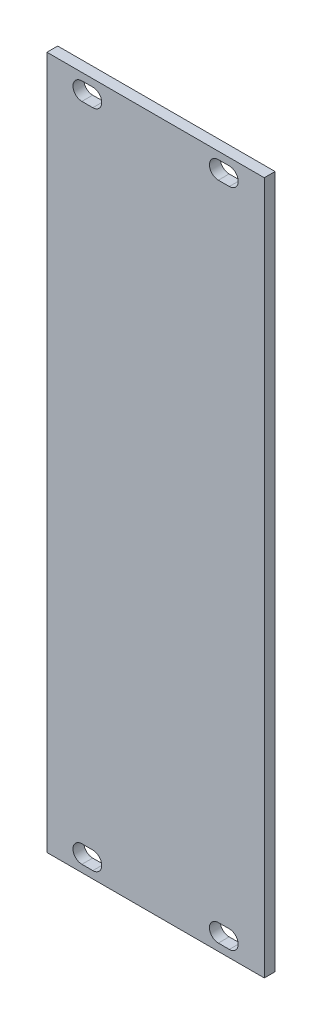
ISO-10303-21;
HEADER;
FILE_DESCRIPTION(('STEP AP214'),'2;1');
FILE_NAME('part.step','',(''),(''),'','','');
FILE_SCHEMA(('AUTOMOTIVE_DESIGN { 1 0 10303 214 1 1 1 1 }'));
ENDSEC;
DATA;
#1=APPLICATION_CONTEXT('core data for automotive mechanical design processes');
#2=APPLICATION_PROTOCOL_DEFINITION('international standard','automotive_design',2000,#1);
#3=PRODUCT_CONTEXT('',#1,'mechanical');
#4=PRODUCT('Part','Part','',(#3));
#5=PRODUCT_RELATED_PRODUCT_CATEGORY('part','',(#4));
#6=PRODUCT_DEFINITION_FORMATION('','',#4);
#7=PRODUCT_DEFINITION_CONTEXT('part definition',#1,'design');
#8=PRODUCT_DEFINITION('design','',#6,#7);
#9=PRODUCT_DEFINITION_SHAPE('','',#8);
#10=(LENGTH_UNIT() NAMED_UNIT(*) SI_UNIT(.MILLI.,.METRE.));
#11=(NAMED_UNIT(*) PLANE_ANGLE_UNIT() SI_UNIT($,.RADIAN.));
#12=(NAMED_UNIT(*) SI_UNIT($,.STERADIAN.) SOLID_ANGLE_UNIT());
#13=UNCERTAINTY_MEASURE_WITH_UNIT(LENGTH_MEASURE(1.E-05),#10,'distance_accuracy_value','');
#14=(GEOMETRIC_REPRESENTATION_CONTEXT(3) GLOBAL_UNCERTAINTY_ASSIGNED_CONTEXT((#13)) GLOBAL_UNIT_ASSIGNED_CONTEXT((#10,
#11,#12)) REPRESENTATION_CONTEXT('',''));
#15=CARTESIAN_POINT('',(0.,0.,0.));
#16=DIRECTION('',(0.,0.,1.));
#17=DIRECTION('',(1.,0.,0.));
#18=AXIS2_PLACEMENT_3D('',#15,#16,#17);
#19=CARTESIAN_POINT('',(0.,0.,2.));
#20=DIRECTION('',(0.,0.,1.));
#21=DIRECTION('',(1.,0.,0.));
#22=AXIS2_PLACEMENT_3D('',#19,#20,#21);
#23=PLANE('',#22);
#24=DIRECTION('',(0.,1.,0.));
#25=VECTOR('',#24,1.);
#26=CARTESIAN_POINT('',(20.15,64.25,2.));
#27=LINE('',#26,#25);
#28=CARTESIAN_POINT('',(20.15,-64.25,2.));
#29=VERTEX_POINT('',#28);
#30=CARTESIAN_POINT('',(20.15,64.25,2.));
#31=VERTEX_POINT('',#30);
#32=EDGE_CURVE('E360',#29,#31,#27,.T.);
#33=ORIENTED_EDGE('',*,*,#32,.T.);
#34=DIRECTION('',(-1.,0.,0.));
#35=VECTOR('',#34,1.);
#36=CARTESIAN_POINT('',(-20.15,64.25,2.));
#37=LINE('',#36,#35);
#38=CARTESIAN_POINT('',(-20.15,64.25,2.));
#39=VERTEX_POINT('',#38);
#40=EDGE_CURVE('E364',#31,#39,#37,.T.);
#41=ORIENTED_EDGE('',*,*,#40,.T.);
#42=DIRECTION('',(0.,-1.,0.));
#43=VECTOR('',#42,1.);
#44=CARTESIAN_POINT('',(-20.15,64.25,2.));
#45=LINE('',#44,#43);
#46=CARTESIAN_POINT('',(-20.15,-64.25,2.));
#47=VERTEX_POINT('',#46);
#48=EDGE_CURVE('E368',#39,#47,#45,.T.);
#49=ORIENTED_EDGE('',*,*,#48,.T.);
#50=DIRECTION('',(1.,0.,0.));
#51=VECTOR('',#50,1.);
#52=CARTESIAN_POINT('',(-20.15,-64.25,2.));
#53=LINE('',#52,#51);
#54=EDGE_CURVE('E371',#47,#29,#53,.T.);
#55=ORIENTED_EDGE('',*,*,#54,.T.);
#56=EDGE_LOOP('',(#33,#41,#49,#55));
#57=FACE_BOUND('',#56,.T.);
#58=DIRECTION('',(1.,0.,0.));
#59=VECTOR('',#58,1.);
#60=CARTESIAN_POINT('',(-13.666,-62.9,2.));
#61=LINE('',#60,#59);
#62=CARTESIAN_POINT('',(-13.666,-62.9,2.));
#63=VERTEX_POINT('',#62);
#64=CARTESIAN_POINT('',(-11.634,-62.9,2.));
#65=VERTEX_POINT('',#64);
#66=EDGE_CURVE('E320',#63,#65,#61,.T.);
#67=ORIENTED_EDGE('',*,*,#66,.F.);
#68=CARTESIAN_POINT('',(-13.666,-61.25,2.));
#69=DIRECTION('',(0.,0.,1.));
#70=DIRECTION('',(1.,0.,0.));
#71=AXIS2_PLACEMENT_3D('',#68,#69,#70);
#72=CIRCLE('',#71,1.65);
#73=CARTESIAN_POINT('',(-13.666,-59.6,2.));
#74=VERTEX_POINT('',#73);
#75=EDGE_CURVE('E317',#74,#63,#72,.T.);
#76=ORIENTED_EDGE('',*,*,#75,.F.);
#77=DIRECTION('',(-1.,0.,0.));
#78=VECTOR('',#77,1.);
#79=CARTESIAN_POINT('',(-13.666,-59.6,2.));
#80=LINE('',#79,#78);
#81=CARTESIAN_POINT('',(-11.634,-59.6,2.));
#82=VERTEX_POINT('',#81);
#83=EDGE_CURVE('E328',#82,#74,#80,.T.);
#84=ORIENTED_EDGE('',*,*,#83,.F.);
#85=CARTESIAN_POINT('',(-11.634,-61.25,2.));
#86=DIRECTION('',(0.,0.,1.));
#87=DIRECTION('',(1.,0.,0.));
#88=AXIS2_PLACEMENT_3D('',#85,#86,#87);
#89=CIRCLE('',#88,1.65000000000001);
#90=EDGE_CURVE('E324',#65,#82,#89,.T.);
#91=ORIENTED_EDGE('',*,*,#90,.F.);
#92=EDGE_LOOP('',(#67,#76,#84,#91));
#93=FACE_BOUND('',#92,.T.);
#94=DIRECTION('',(1.,0.,0.));
#95=VECTOR('',#94,1.);
#96=CARTESIAN_POINT('',(11.634000014,59.6,2.));
#97=LINE('',#96,#95);
#98=CARTESIAN_POINT('',(11.634000014,59.6,2.));
#99=VERTEX_POINT('',#98);
#100=CARTESIAN_POINT('',(13.666000014,59.6,2.));
#101=VERTEX_POINT('',#100);
#102=EDGE_CURVE('E277',#99,#101,#97,.T.);
#103=ORIENTED_EDGE('',*,*,#102,.F.);
#104=CARTESIAN_POINT('',(11.634000014,61.25,2.));
#105=DIRECTION('',(0.,0.,1.));
#106=DIRECTION('',(1.,0.,0.));
#107=AXIS2_PLACEMENT_3D('',#104,#105,#106);
#108=CIRCLE('',#107,1.65);
#109=CARTESIAN_POINT('',(11.634000014,62.9,2.));
#110=VERTEX_POINT('',#109);
#111=EDGE_CURVE('E274',#110,#99,#108,.T.);
#112=ORIENTED_EDGE('',*,*,#111,.F.);
#113=DIRECTION('',(-1.,0.,0.));
#114=VECTOR('',#113,1.);
#115=CARTESIAN_POINT('',(11.634000014,62.9,2.));
#116=LINE('',#115,#114);
#117=CARTESIAN_POINT('',(13.666000014,62.9,2.));
#118=VERTEX_POINT('',#117);
#119=EDGE_CURVE('E285',#118,#110,#116,.T.);
#120=ORIENTED_EDGE('',*,*,#119,.F.);
#121=CARTESIAN_POINT('',(13.666000014,61.25,2.));
#122=DIRECTION('',(0.,0.,1.));
#123=DIRECTION('',(1.,0.,0.));
#124=AXIS2_PLACEMENT_3D('',#121,#122,#123);
#125=CIRCLE('',#124,1.65);
#126=EDGE_CURVE('E281',#101,#118,#125,.T.);
#127=ORIENTED_EDGE('',*,*,#126,.F.);
#128=EDGE_LOOP('',(#103,#112,#120,#127));
#129=FACE_BOUND('',#128,.T.);
#130=DIRECTION('',(1.,0.,0.));
#131=VECTOR('',#130,1.);
#132=CARTESIAN_POINT('',(-13.666,59.6,2.));
#133=LINE('',#132,#131);
#134=CARTESIAN_POINT('',(-13.666,59.6,2.));
#135=VERTEX_POINT('',#134);
#136=CARTESIAN_POINT('',(-11.634,59.6,2.));
#137=VERTEX_POINT('',#136);
#138=EDGE_CURVE('E234',#135,#137,#133,.T.);
#139=ORIENTED_EDGE('',*,*,#138,.F.);
#140=CARTESIAN_POINT('',(-13.666,61.25,2.));
#141=DIRECTION('',(0.,0.,1.));
#142=DIRECTION('',(1.,0.,0.));
#143=AXIS2_PLACEMENT_3D('',#140,#141,#142);
#144=CIRCLE('',#143,1.65);
#145=CARTESIAN_POINT('',(-13.666,62.9,2.));
#146=VERTEX_POINT('',#145);
#147=EDGE_CURVE('E231',#146,#135,#144,.T.);
#148=ORIENTED_EDGE('',*,*,#147,.F.);
#149=DIRECTION('',(-1.,0.,0.));
#150=VECTOR('',#149,1.);
#151=CARTESIAN_POINT('',(-13.666,62.9,2.));
#152=LINE('',#151,#150);
#153=CARTESIAN_POINT('',(-11.634,62.9,2.));
#154=VERTEX_POINT('',#153);
#155=EDGE_CURVE('E242',#154,#146,#152,.T.);
#156=ORIENTED_EDGE('',*,*,#155,.F.);
#157=CARTESIAN_POINT('',(-11.634,61.25,2.));
#158=DIRECTION('',(0.,0.,1.));
#159=DIRECTION('',(1.,0.,0.));
#160=AXIS2_PLACEMENT_3D('',#157,#158,#159);
#161=CIRCLE('',#160,1.65);
#162=EDGE_CURVE('E238',#137,#154,#161,.T.);
#163=ORIENTED_EDGE('',*,*,#162,.F.);
#164=EDGE_LOOP('',(#139,#148,#156,#163));
#165=FACE_BOUND('',#164,.T.);
#166=DIRECTION('',(1.,0.,0.));
#167=VECTOR('',#166,1.);
#168=CARTESIAN_POINT('',(11.634000014,-62.9,2.));
#169=LINE('',#168,#167);
#170=CARTESIAN_POINT('',(11.634000014,-62.9,2.));
#171=VERTEX_POINT('',#170);
#172=CARTESIAN_POINT('',(13.666000014,-62.9,2.));
#173=VERTEX_POINT('',#172);
#174=EDGE_CURVE('E192',#171,#173,#169,.T.);
#175=ORIENTED_EDGE('',*,*,#174,.F.);
#176=CARTESIAN_POINT('',(11.634000014,-61.25,2.));
#177=DIRECTION('',(0.,0.,1.));
#178=DIRECTION('',(1.,0.,0.));
#179=AXIS2_PLACEMENT_3D('',#176,#177,#178);
#180=CIRCLE('',#179,1.65);
#181=CARTESIAN_POINT('',(11.634000014,-59.6,2.));
#182=VERTEX_POINT('',#181);
#183=EDGE_CURVE('E183',#182,#171,#180,.T.);
#184=ORIENTED_EDGE('',*,*,#183,.F.);
#185=DIRECTION('',(-1.,0.,0.));
#186=VECTOR('',#185,1.);
#187=CARTESIAN_POINT('',(11.634000014,-59.6,2.));
#188=LINE('',#187,#186);
#189=CARTESIAN_POINT('',(13.666000014,-59.6,2.));
#190=VERTEX_POINT('',#189);
#191=EDGE_CURVE('E209',#190,#182,#188,.T.);
#192=ORIENTED_EDGE('',*,*,#191,.F.);
#193=CARTESIAN_POINT('',(13.666000014,-61.25,2.));
#194=DIRECTION('',(0.,0.,1.));
#195=DIRECTION('',(1.,0.,0.));
#196=AXIS2_PLACEMENT_3D('',#193,#194,#195);
#197=CIRCLE('',#196,1.65);
#198=EDGE_CURVE('E205',#173,#190,#197,.T.);
#199=ORIENTED_EDGE('',*,*,#198,.F.);
#200=EDGE_LOOP('',(#175,#184,#192,#199));
#201=FACE_BOUND('',#200,.T.);
#202=ADVANCED_FACE('F45',(#57,#93,#129,#165,#201),#23,.T.);
#203=CARTESIAN_POINT('',(0.,0.,0.));
#204=DIRECTION('',(0.,0.,1.));
#205=DIRECTION('',(1.,0.,0.));
#206=AXIS2_PLACEMENT_3D('',#203,#204,#205);
#207=PLANE('',#206);
#208=CARTESIAN_POINT('',(-13.666,61.25,0.));
#209=DIRECTION('',(0.,0.,1.));
#210=DIRECTION('',(1.,0.,0.));
#211=AXIS2_PLACEMENT_3D('',#208,#209,#210);
#212=CIRCLE('',#211,1.65);
#213=CARTESIAN_POINT('',(-13.666,62.9,0.));
#214=VERTEX_POINT('',#213);
#215=CARTESIAN_POINT('',(-13.666,59.6,0.));
#216=VERTEX_POINT('',#215);
#217=EDGE_CURVE('E201',#214,#216,#212,.T.);
#218=ORIENTED_EDGE('',*,*,#217,.T.);
#219=DIRECTION('',(1.,0.,0.));
#220=VECTOR('',#219,1.);
#221=CARTESIAN_POINT('',(-13.666,59.6,0.));
#222=LINE('',#221,#220);
#223=CARTESIAN_POINT('',(-11.634,59.6,0.));
#224=VERTEX_POINT('',#223);
#225=EDGE_CURVE('E249',#216,#224,#222,.T.);
#226=ORIENTED_EDGE('',*,*,#225,.T.);
#227=CARTESIAN_POINT('',(-11.634,61.25,0.));
#228=DIRECTION('',(0.,0.,1.));
#229=DIRECTION('',(1.,0.,0.));
#230=AXIS2_PLACEMENT_3D('',#227,#228,#229);
#231=CIRCLE('',#230,1.65);
#232=CARTESIAN_POINT('',(-11.634,62.9,0.));
#233=VERTEX_POINT('',#232);
#234=EDGE_CURVE('E253',#224,#233,#231,.T.);
#235=ORIENTED_EDGE('',*,*,#234,.T.);
#236=DIRECTION('',(-1.,0.,0.));
#237=VECTOR('',#236,1.);
#238=CARTESIAN_POINT('',(-13.666,62.9,0.));
#239=LINE('',#238,#237);
#240=EDGE_CURVE('E235',#233,#214,#239,.T.);
#241=ORIENTED_EDGE('',*,*,#240,.T.);
#242=EDGE_LOOP('',(#218,#226,#235,#241));
#243=FACE_BOUND('',#242,.T.);
#244=CARTESIAN_POINT('',(-13.666,-61.25,0.));
#245=DIRECTION('',(0.,0.,1.));
#246=DIRECTION('',(1.,0.,0.));
#247=AXIS2_PLACEMENT_3D('',#244,#245,#246);
#248=CIRCLE('',#247,1.65);
#249=CARTESIAN_POINT('',(-13.666,-59.6,0.));
#250=VERTEX_POINT('',#249);
#251=CARTESIAN_POINT('',(-13.666,-62.9,0.));
#252=VERTEX_POINT('',#251);
#253=EDGE_CURVE('E316',#250,#252,#248,.T.);
#254=ORIENTED_EDGE('',*,*,#253,.T.);
#255=DIRECTION('',(1.,0.,0.));
#256=VECTOR('',#255,1.);
#257=CARTESIAN_POINT('',(-13.666,-62.9,0.));
#258=LINE('',#257,#256);
#259=CARTESIAN_POINT('',(-11.634,-62.9,0.));
#260=VERTEX_POINT('',#259);
#261=EDGE_CURVE('E335',#252,#260,#258,.T.);
#262=ORIENTED_EDGE('',*,*,#261,.T.);
#263=CARTESIAN_POINT('',(-11.634,-61.25,0.));
#264=DIRECTION('',(0.,0.,1.));
#265=DIRECTION('',(1.,0.,0.));
#266=AXIS2_PLACEMENT_3D('',#263,#264,#265);
#267=CIRCLE('',#266,1.65000000000001);
#268=CARTESIAN_POINT('',(-11.634,-59.6,0.));
#269=VERTEX_POINT('',#268);
#270=EDGE_CURVE('E339',#260,#269,#267,.T.);
#271=ORIENTED_EDGE('',*,*,#270,.T.);
#272=DIRECTION('',(-1.,0.,0.));
#273=VECTOR('',#272,1.);
#274=CARTESIAN_POINT('',(-13.666,-59.6,0.));
#275=LINE('',#274,#273);
#276=EDGE_CURVE('E321',#269,#250,#275,.T.);
#277=ORIENTED_EDGE('',*,*,#276,.T.);
#278=EDGE_LOOP('',(#254,#262,#271,#277));
#279=FACE_BOUND('',#278,.T.);
#280=DIRECTION('',(0.,1.,0.));
#281=VECTOR('',#280,1.);
#282=CARTESIAN_POINT('',(20.15,64.25,0.));
#283=LINE('',#282,#281);
#284=CARTESIAN_POINT('',(20.15,-64.25,0.));
#285=VERTEX_POINT('',#284);
#286=CARTESIAN_POINT('',(20.15,64.25,0.));
#287=VERTEX_POINT('',#286);
#288=EDGE_CURVE('E359',#285,#287,#283,.T.);
#289=ORIENTED_EDGE('',*,*,#288,.F.);
#290=DIRECTION('',(1.,0.,0.));
#291=VECTOR('',#290,1.);
#292=CARTESIAN_POINT('',(-20.15,-64.25,0.));
#293=LINE('',#292,#291);
#294=CARTESIAN_POINT('',(-20.15,-64.25,0.));
#295=VERTEX_POINT('',#294);
#296=EDGE_CURVE('E365',#295,#285,#293,.T.);
#297=ORIENTED_EDGE('',*,*,#296,.F.);
#298=DIRECTION('',(0.,-1.,0.));
#299=VECTOR('',#298,1.);
#300=CARTESIAN_POINT('',(-20.15,64.25,0.));
#301=LINE('',#300,#299);
#302=CARTESIAN_POINT('',(-20.15,64.25,0.));
#303=VERTEX_POINT('',#302);
#304=EDGE_CURVE('E381',#303,#295,#301,.T.);
#305=ORIENTED_EDGE('',*,*,#304,.F.);
#306=DIRECTION('',(-1.,0.,0.));
#307=VECTOR('',#306,1.);
#308=CARTESIAN_POINT('',(-20.15,64.25,0.));
#309=LINE('',#308,#307);
#310=EDGE_CURVE('E378',#287,#303,#309,.T.);
#311=ORIENTED_EDGE('',*,*,#310,.F.);
#312=EDGE_LOOP('',(#289,#297,#305,#311));
#313=FACE_BOUND('',#312,.T.);
#314=CARTESIAN_POINT('',(11.634000014,61.25,0.));
#315=DIRECTION('',(0.,0.,1.));
#316=DIRECTION('',(1.,0.,0.));
#317=AXIS2_PLACEMENT_3D('',#314,#315,#316);
#318=CIRCLE('',#317,1.65);
#319=CARTESIAN_POINT('',(11.634000014,62.9,0.));
#320=VERTEX_POINT('',#319);
#321=CARTESIAN_POINT('',(11.634000014,59.6,0.));
#322=VERTEX_POINT('',#321);
#323=EDGE_CURVE('E273',#320,#322,#318,.T.);
#324=ORIENTED_EDGE('',*,*,#323,.T.);
#325=DIRECTION('',(1.,0.,0.));
#326=VECTOR('',#325,1.);
#327=CARTESIAN_POINT('',(11.634000014,59.6,0.));
#328=LINE('',#327,#326);
#329=CARTESIAN_POINT('',(13.666000014,59.6,0.));
#330=VERTEX_POINT('',#329);
#331=EDGE_CURVE('E292',#322,#330,#328,.T.);
#332=ORIENTED_EDGE('',*,*,#331,.T.);
#333=CARTESIAN_POINT('',(13.666000014,61.25,0.));
#334=DIRECTION('',(0.,0.,1.));
#335=DIRECTION('',(1.,0.,0.));
#336=AXIS2_PLACEMENT_3D('',#333,#334,#335);
#337=CIRCLE('',#336,1.65);
#338=CARTESIAN_POINT('',(13.666000014,62.9,0.));
#339=VERTEX_POINT('',#338);
#340=EDGE_CURVE('E296',#330,#339,#337,.T.);
#341=ORIENTED_EDGE('',*,*,#340,.T.);
#342=DIRECTION('',(-1.,0.,0.));
#343=VECTOR('',#342,1.);
#344=CARTESIAN_POINT('',(11.634000014,62.9,0.));
#345=LINE('',#344,#343);
#346=EDGE_CURVE('E278',#339,#320,#345,.T.);
#347=ORIENTED_EDGE('',*,*,#346,.T.);
#348=EDGE_LOOP('',(#324,#332,#341,#347));
#349=FACE_BOUND('',#348,.T.);
#350=CARTESIAN_POINT('',(11.634000014,-61.25,0.));
#351=DIRECTION('',(0.,0.,1.));
#352=DIRECTION('',(1.,0.,0.));
#353=AXIS2_PLACEMENT_3D('',#350,#351,#352);
#354=CIRCLE('',#353,1.65);
#355=CARTESIAN_POINT('',(11.634000014,-59.6,0.));
#356=VERTEX_POINT('',#355);
#357=CARTESIAN_POINT('',(11.634000014,-62.9,0.));
#358=VERTEX_POINT('',#357);
#359=EDGE_CURVE('E69',#356,#358,#354,.T.);
#360=ORIENTED_EDGE('',*,*,#359,.T.);
#361=DIRECTION('',(1.,0.,0.));
#362=VECTOR('',#361,1.);
#363=CARTESIAN_POINT('',(11.634000014,-62.9,0.));
#364=LINE('',#363,#362);
#365=CARTESIAN_POINT('',(13.666000014,-62.9,0.));
#366=VERTEX_POINT('',#365);
#367=EDGE_CURVE('E199',#358,#366,#364,.T.);
#368=ORIENTED_EDGE('',*,*,#367,.T.);
#369=CARTESIAN_POINT('',(13.666000014,-61.25,0.));
#370=DIRECTION('',(0.,0.,1.));
#371=DIRECTION('',(1.,0.,0.));
#372=AXIS2_PLACEMENT_3D('',#369,#370,#371);
#373=CIRCLE('',#372,1.65);
#374=CARTESIAN_POINT('',(13.666000014,-59.6,0.));
#375=VERTEX_POINT('',#374);
#376=EDGE_CURVE('E218',#366,#375,#373,.T.);
#377=ORIENTED_EDGE('',*,*,#376,.T.);
#378=DIRECTION('',(-1.,0.,0.));
#379=VECTOR('',#378,1.);
#380=CARTESIAN_POINT('',(11.634000014,-59.6,0.));
#381=LINE('',#380,#379);
#382=EDGE_CURVE('E193',#375,#356,#381,.T.);
#383=ORIENTED_EDGE('',*,*,#382,.T.);
#384=EDGE_LOOP('',(#360,#368,#377,#383));
#385=FACE_BOUND('',#384,.T.);
#386=ADVANCED_FACE('F404',(#243,#279,#313,#349,#385),#207,.F.);
#387=CARTESIAN_POINT('',(20.15,64.25,2.));
#388=DIRECTION('',(-1.,0.,0.));
#389=DIRECTION('',(0.,-1.,0.));
#390=AXIS2_PLACEMENT_3D('',#387,#388,#389);
#391=PLANE('',#390);
#392=ORIENTED_EDGE('',*,*,#288,.T.);
#393=DIRECTION('',(0.,0.,-1.));
#394=VECTOR('',#393,1.);
#395=CARTESIAN_POINT('',(20.15,64.25,2.));
#396=LINE('',#395,#394);
#397=EDGE_CURVE('E11',#31,#287,#396,.T.);
#398=ORIENTED_EDGE('',*,*,#397,.F.);
#399=ORIENTED_EDGE('',*,*,#32,.F.);
#400=DIRECTION('',(0.,0.,-1.));
#401=VECTOR('',#400,1.);
#402=CARTESIAN_POINT('',(20.15,-64.25,2.));
#403=LINE('',#402,#401);
#404=EDGE_CURVE('E374',#29,#285,#403,.T.);
#405=ORIENTED_EDGE('',*,*,#404,.T.);
#406=EDGE_LOOP('',(#392,#398,#399,#405));
#407=FACE_BOUND('',#406,.T.);
#408=ADVANCED_FACE('F47',(#407),#391,.F.);
#409=CARTESIAN_POINT('',(-20.15,64.25,2.));
#410=DIRECTION('',(0.,-1.,0.));
#411=DIRECTION('',(0.,0.,-1.));
#412=AXIS2_PLACEMENT_3D('',#409,#410,#411);
#413=PLANE('',#412);
#414=ORIENTED_EDGE('',*,*,#310,.T.);
#415=DIRECTION('',(0.,0.,-1.));
#416=VECTOR('',#415,1.);
#417=CARTESIAN_POINT('',(-20.15,64.25,2.));
#418=LINE('',#417,#416);
#419=EDGE_CURVE('E54',#39,#303,#418,.T.);
#420=ORIENTED_EDGE('',*,*,#419,.F.);
#421=ORIENTED_EDGE('',*,*,#40,.F.);
#422=ORIENTED_EDGE('',*,*,#397,.T.);
#423=EDGE_LOOP('',(#414,#420,#421,#422));
#424=FACE_BOUND('',#423,.T.);
#425=ADVANCED_FACE('F415',(#424),#413,.F.);
#426=CARTESIAN_POINT('',(-20.15,64.25,2.));
#427=DIRECTION('',(1.,0.,0.));
#428=DIRECTION('',(0.,1.,0.));
#429=AXIS2_PLACEMENT_3D('',#426,#427,#428);
#430=PLANE('',#429);
#431=ORIENTED_EDGE('',*,*,#304,.T.);
#432=DIRECTION('',(0.,0.,-1.));
#433=VECTOR('',#432,1.);
#434=CARTESIAN_POINT('',(-20.15,-64.25,2.));
#435=LINE('',#434,#433);
#436=EDGE_CURVE('E389',#47,#295,#435,.T.);
#437=ORIENTED_EDGE('',*,*,#436,.F.);
#438=ORIENTED_EDGE('',*,*,#48,.F.);
#439=ORIENTED_EDGE('',*,*,#419,.T.);
#440=EDGE_LOOP('',(#431,#437,#438,#439));
#441=FACE_BOUND('',#440,.T.);
#442=ADVANCED_FACE('F398',(#441),#430,.F.);
#443=CARTESIAN_POINT('',(-20.15,-64.25,2.));
#444=DIRECTION('',(0.,1.,0.));
#445=DIRECTION('',(-1.,0.,0.));
#446=AXIS2_PLACEMENT_3D('',#443,#444,#445);
#447=PLANE('',#446);
#448=ORIENTED_EDGE('',*,*,#296,.T.);
#449=ORIENTED_EDGE('',*,*,#404,.F.);
#450=ORIENTED_EDGE('',*,*,#54,.F.);
#451=ORIENTED_EDGE('',*,*,#436,.T.);
#452=EDGE_LOOP('',(#448,#449,#450,#451));
#453=FACE_BOUND('',#452,.T.);
#454=ADVANCED_FACE('F408',(#453),#447,.F.);
#455=CARTESIAN_POINT('',(-13.666,-61.25,2.));
#456=DIRECTION('',(0.,0.,-1.));
#457=DIRECTION('',(-1.,0.,0.));
#458=AXIS2_PLACEMENT_3D('',#455,#456,#457);
#459=CYLINDRICAL_SURFACE('',#458,1.65);
#460=ORIENTED_EDGE('',*,*,#253,.F.);
#461=DIRECTION('',(0.,0.,-1.));
#462=VECTOR('',#461,1.);
#463=CARTESIAN_POINT('',(-13.666,-59.6,2.));
#464=LINE('',#463,#462);
#465=EDGE_CURVE('E331',#74,#250,#464,.T.);
#466=ORIENTED_EDGE('',*,*,#465,.F.);
#467=ORIENTED_EDGE('',*,*,#75,.T.);
#468=DIRECTION('',(0.,0.,-1.));
#469=VECTOR('',#468,1.);
#470=CARTESIAN_POINT('',(-13.666,-62.9,2.));
#471=LINE('',#470,#469);
#472=EDGE_CURVE('E355',#63,#252,#471,.T.);
#473=ORIENTED_EDGE('',*,*,#472,.T.);
#474=EDGE_LOOP('',(#460,#466,#467,#473));
#475=FACE_BOUND('',#474,.T.);
#476=ADVANCED_FACE('F430',(#475),#459,.F.);
#477=CARTESIAN_POINT('',(-13.666,-62.9,2.));
#478=DIRECTION('',(0.,1.,0.));
#479=DIRECTION('',(-1.,0.,0.));
#480=AXIS2_PLACEMENT_3D('',#477,#478,#479);
#481=PLANE('',#480);
#482=ORIENTED_EDGE('',*,*,#261,.F.);
#483=ORIENTED_EDGE('',*,*,#472,.F.);
#484=ORIENTED_EDGE('',*,*,#66,.T.);
#485=DIRECTION('',(0.,0.,-1.));
#486=VECTOR('',#485,1.);
#487=CARTESIAN_POINT('',(-11.634,-62.9,2.));
#488=LINE('',#487,#486);
#489=EDGE_CURVE('E352',#65,#260,#488,.T.);
#490=ORIENTED_EDGE('',*,*,#489,.T.);
#491=EDGE_LOOP('',(#482,#483,#484,#490));
#492=FACE_BOUND('',#491,.T.);
#493=ADVANCED_FACE('F437',(#492),#481,.T.);
#494=CARTESIAN_POINT('',(-11.634,-61.25,2.));
#495=DIRECTION('',(0.,0.,-1.));
#496=DIRECTION('',(-1.,0.,0.));
#497=AXIS2_PLACEMENT_3D('',#494,#495,#496);
#498=CYLINDRICAL_SURFACE('',#497,1.65000000000001);
#499=ORIENTED_EDGE('',*,*,#270,.F.);
#500=ORIENTED_EDGE('',*,*,#489,.F.);
#501=ORIENTED_EDGE('',*,*,#90,.T.);
#502=DIRECTION('',(0.,0.,-1.));
#503=VECTOR('',#502,1.);
#504=CARTESIAN_POINT('',(-11.634,-59.6,2.));
#505=LINE('',#504,#503);
#506=EDGE_CURVE('E349',#82,#269,#505,.T.);
#507=ORIENTED_EDGE('',*,*,#506,.T.);
#508=EDGE_LOOP('',(#499,#500,#501,#507));
#509=FACE_BOUND('',#508,.T.);
#510=ADVANCED_FACE('F442',(#509),#498,.F.);
#511=CARTESIAN_POINT('',(-13.666,-59.6,2.));
#512=DIRECTION('',(0.,-1.,0.));
#513=DIRECTION('',(0.,0.,-1.));
#514=AXIS2_PLACEMENT_3D('',#511,#512,#513);
#515=PLANE('',#514);
#516=ORIENTED_EDGE('',*,*,#276,.F.);
#517=ORIENTED_EDGE('',*,*,#506,.F.);
#518=ORIENTED_EDGE('',*,*,#83,.T.);
#519=ORIENTED_EDGE('',*,*,#465,.T.);
#520=EDGE_LOOP('',(#516,#517,#518,#519));
#521=FACE_BOUND('',#520,.T.);
#522=ADVANCED_FACE('F450',(#521),#515,.T.);
#523=CARTESIAN_POINT('',(11.634000014,61.25,2.));
#524=DIRECTION('',(0.,0.,-1.));
#525=DIRECTION('',(-1.,0.,0.));
#526=AXIS2_PLACEMENT_3D('',#523,#524,#525);
#527=CYLINDRICAL_SURFACE('',#526,1.65);
#528=ORIENTED_EDGE('',*,*,#323,.F.);
#529=DIRECTION('',(0.,0.,-1.));
#530=VECTOR('',#529,1.);
#531=CARTESIAN_POINT('',(11.634000014,62.9,2.));
#532=LINE('',#531,#530);
#533=EDGE_CURVE('E288',#110,#320,#532,.T.);
#534=ORIENTED_EDGE('',*,*,#533,.F.);
#535=ORIENTED_EDGE('',*,*,#111,.T.);
#536=DIRECTION('',(0.,0.,-1.));
#537=VECTOR('',#536,1.);
#538=CARTESIAN_POINT('',(11.634000014,59.6,2.));
#539=LINE('',#538,#537);
#540=EDGE_CURVE('E312',#99,#322,#539,.T.);
#541=ORIENTED_EDGE('',*,*,#540,.T.);
#542=EDGE_LOOP('',(#528,#534,#535,#541));
#543=FACE_BOUND('',#542,.T.);
#544=ADVANCED_FACE('F504',(#543),#527,.F.);
#545=CARTESIAN_POINT('',(11.634000014,59.6,2.));
#546=DIRECTION('',(0.,1.,0.));
#547=DIRECTION('',(0.,0.,1.));
#548=AXIS2_PLACEMENT_3D('',#545,#546,#547);
#549=PLANE('',#548);
#550=ORIENTED_EDGE('',*,*,#331,.F.);
#551=ORIENTED_EDGE('',*,*,#540,.F.);
#552=ORIENTED_EDGE('',*,*,#102,.T.);
#553=DIRECTION('',(0.,0.,-1.));
#554=VECTOR('',#553,1.);
#555=CARTESIAN_POINT('',(13.666000014,59.6,2.));
#556=LINE('',#555,#554);
#557=EDGE_CURVE('E309',#101,#330,#556,.T.);
#558=ORIENTED_EDGE('',*,*,#557,.T.);
#559=EDGE_LOOP('',(#550,#551,#552,#558));
#560=FACE_BOUND('',#559,.T.);
#561=ADVANCED_FACE('F500',(#560),#549,.T.);
#562=CARTESIAN_POINT('',(13.666000014,61.25,2.));
#563=DIRECTION('',(0.,0.,-1.));
#564=DIRECTION('',(-1.,0.,0.));
#565=AXIS2_PLACEMENT_3D('',#562,#563,#564);
#566=CYLINDRICAL_SURFACE('',#565,1.65);
#567=ORIENTED_EDGE('',*,*,#340,.F.);
#568=ORIENTED_EDGE('',*,*,#557,.F.);
#569=ORIENTED_EDGE('',*,*,#126,.T.);
#570=DIRECTION('',(0.,0.,-1.));
#571=VECTOR('',#570,1.);
#572=CARTESIAN_POINT('',(13.666000014,62.9,2.));
#573=LINE('',#572,#571);
#574=EDGE_CURVE('E306',#118,#339,#573,.T.);
#575=ORIENTED_EDGE('',*,*,#574,.T.);
#576=EDGE_LOOP('',(#567,#568,#569,#575));
#577=FACE_BOUND('',#576,.T.);
#578=ADVANCED_FACE('F496',(#577),#566,.F.);
#579=CARTESIAN_POINT('',(11.634000014,62.9,2.));
#580=DIRECTION('',(0.,-1.,0.));
#581=DIRECTION('',(0.,0.,-1.));
#582=AXIS2_PLACEMENT_3D('',#579,#580,#581);
#583=PLANE('',#582);
#584=ORIENTED_EDGE('',*,*,#346,.F.);
#585=ORIENTED_EDGE('',*,*,#574,.F.);
#586=ORIENTED_EDGE('',*,*,#119,.T.);
#587=ORIENTED_EDGE('',*,*,#533,.T.);
#588=EDGE_LOOP('',(#584,#585,#586,#587));
#589=FACE_BOUND('',#588,.T.);
#590=ADVANCED_FACE('F493',(#589),#583,.T.);
#591=CARTESIAN_POINT('',(-13.666,61.25,2.));
#592=DIRECTION('',(0.,0.,-1.));
#593=DIRECTION('',(-1.,0.,0.));
#594=AXIS2_PLACEMENT_3D('',#591,#592,#593);
#595=CYLINDRICAL_SURFACE('',#594,1.65);
#596=ORIENTED_EDGE('',*,*,#217,.F.);
#597=DIRECTION('',(0.,0.,-1.));
#598=VECTOR('',#597,1.);
#599=CARTESIAN_POINT('',(-13.666,62.9,2.));
#600=LINE('',#599,#598);
#601=EDGE_CURVE('E245',#146,#214,#600,.T.);
#602=ORIENTED_EDGE('',*,*,#601,.F.);
#603=ORIENTED_EDGE('',*,*,#147,.T.);
#604=DIRECTION('',(0.,0.,-1.));
#605=VECTOR('',#604,1.);
#606=CARTESIAN_POINT('',(-13.666,59.6,2.));
#607=LINE('',#606,#605);
#608=EDGE_CURVE('E269',#135,#216,#607,.T.);
#609=ORIENTED_EDGE('',*,*,#608,.T.);
#610=EDGE_LOOP('',(#596,#602,#603,#609));
#611=FACE_BOUND('',#610,.T.);
#612=ADVANCED_FACE('F475',(#611),#595,.F.);
#613=CARTESIAN_POINT('',(-13.666,59.6,2.));
#614=DIRECTION('',(0.,1.,0.));
#615=DIRECTION('',(0.,0.,1.));
#616=AXIS2_PLACEMENT_3D('',#613,#614,#615);
#617=PLANE('',#616);
#618=ORIENTED_EDGE('',*,*,#225,.F.);
#619=ORIENTED_EDGE('',*,*,#608,.F.);
#620=ORIENTED_EDGE('',*,*,#138,.T.);
#621=DIRECTION('',(0.,0.,-1.));
#622=VECTOR('',#621,1.);
#623=CARTESIAN_POINT('',(-11.634,59.6,2.));
#624=LINE('',#623,#622);
#625=EDGE_CURVE('E266',#137,#224,#624,.T.);
#626=ORIENTED_EDGE('',*,*,#625,.T.);
#627=EDGE_LOOP('',(#618,#619,#620,#626));
#628=FACE_BOUND('',#627,.T.);
#629=ADVANCED_FACE('F469',(#628),#617,.T.);
#630=CARTESIAN_POINT('',(-11.634,61.25,2.));
#631=DIRECTION('',(0.,0.,-1.));
#632=DIRECTION('',(-1.,0.,0.));
#633=AXIS2_PLACEMENT_3D('',#630,#631,#632);
#634=CYLINDRICAL_SURFACE('',#633,1.65);
#635=ORIENTED_EDGE('',*,*,#234,.F.);
#636=ORIENTED_EDGE('',*,*,#625,.F.);
#637=ORIENTED_EDGE('',*,*,#162,.T.);
#638=DIRECTION('',(0.,0.,-1.));
#639=VECTOR('',#638,1.);
#640=CARTESIAN_POINT('',(-11.634,62.9,2.));
#641=LINE('',#640,#639);
#642=EDGE_CURVE('E263',#154,#233,#641,.T.);
#643=ORIENTED_EDGE('',*,*,#642,.T.);
#644=EDGE_LOOP('',(#635,#636,#637,#643));
#645=FACE_BOUND('',#644,.T.);
#646=ADVANCED_FACE('F472',(#645),#634,.F.);
#647=CARTESIAN_POINT('',(-13.666,62.9,2.));
#648=DIRECTION('',(0.,-1.,0.));
#649=DIRECTION('',(0.,0.,-1.));
#650=AXIS2_PLACEMENT_3D('',#647,#648,#649);
#651=PLANE('',#650);
#652=ORIENTED_EDGE('',*,*,#240,.F.);
#653=ORIENTED_EDGE('',*,*,#642,.F.);
#654=ORIENTED_EDGE('',*,*,#155,.T.);
#655=ORIENTED_EDGE('',*,*,#601,.T.);
#656=EDGE_LOOP('',(#652,#653,#654,#655));
#657=FACE_BOUND('',#656,.T.);
#658=ADVANCED_FACE('F478',(#657),#651,.T.);
#659=CARTESIAN_POINT('',(11.634000014,-61.25,2.));
#660=DIRECTION('',(0.,0.,-1.));
#661=DIRECTION('',(-1.,0.,0.));
#662=AXIS2_PLACEMENT_3D('',#659,#660,#661);
#663=CYLINDRICAL_SURFACE('',#662,1.65);
#664=ORIENTED_EDGE('',*,*,#359,.F.);
#665=DIRECTION('',(0.,0.,-1.));
#666=VECTOR('',#665,1.);
#667=CARTESIAN_POINT('',(11.634000014,-59.6,2.));
#668=LINE('',#667,#666);
#669=EDGE_CURVE('E187',#182,#356,#668,.T.);
#670=ORIENTED_EDGE('',*,*,#669,.F.);
#671=ORIENTED_EDGE('',*,*,#183,.T.);
#672=DIRECTION('',(0.,0.,-1.));
#673=VECTOR('',#672,1.);
#674=CARTESIAN_POINT('',(11.634000014,-62.9,2.));
#675=LINE('',#674,#673);
#676=EDGE_CURVE('E186',#171,#358,#675,.T.);
#677=ORIENTED_EDGE('',*,*,#676,.T.);
#678=EDGE_LOOP('',(#664,#670,#671,#677));
#679=FACE_BOUND('',#678,.T.);
#680=ADVANCED_FACE('F185',(#679),#663,.F.);
#681=CARTESIAN_POINT('',(11.634000014,-62.9,2.));
#682=DIRECTION('',(0.,1.,0.));
#683=DIRECTION('',(0.,0.,1.));
#684=AXIS2_PLACEMENT_3D('',#681,#682,#683);
#685=PLANE('',#684);
#686=ORIENTED_EDGE('',*,*,#367,.F.);
#687=ORIENTED_EDGE('',*,*,#676,.F.);
#688=ORIENTED_EDGE('',*,*,#174,.T.);
#689=DIRECTION('',(0.,0.,-1.));
#690=VECTOR('',#689,1.);
#691=CARTESIAN_POINT('',(13.666000014,-62.9,2.));
#692=LINE('',#691,#690);
#693=EDGE_CURVE('E202',#173,#366,#692,.T.);
#694=ORIENTED_EDGE('',*,*,#693,.T.);
#695=EDGE_LOOP('',(#686,#687,#688,#694));
#696=FACE_BOUND('',#695,.T.);
#697=ADVANCED_FACE('F196',(#696),#685,.T.);
#698=CARTESIAN_POINT('',(13.666000014,-61.25,2.));
#699=DIRECTION('',(0.,0.,-1.));
#700=DIRECTION('',(-1.,0.,0.));
#701=AXIS2_PLACEMENT_3D('',#698,#699,#700);
#702=CYLINDRICAL_SURFACE('',#701,1.65);
#703=ORIENTED_EDGE('',*,*,#376,.F.);
#704=ORIENTED_EDGE('',*,*,#693,.F.);
#705=ORIENTED_EDGE('',*,*,#198,.T.);
#706=DIRECTION('',(0.,0.,-1.));
#707=VECTOR('',#706,1.);
#708=CARTESIAN_POINT('',(13.666000014,-59.6,2.));
#709=LINE('',#708,#707);
#710=EDGE_CURVE('E61',#190,#375,#709,.T.);
#711=ORIENTED_EDGE('',*,*,#710,.T.);
#712=EDGE_LOOP('',(#703,#704,#705,#711));
#713=FACE_BOUND('',#712,.T.);
#714=ADVANCED_FACE('F576',(#713),#702,.F.);
#715=CARTESIAN_POINT('',(11.634000014,-59.6,2.));
#716=DIRECTION('',(0.,-1.,0.));
#717=DIRECTION('',(0.,0.,-1.));
#718=AXIS2_PLACEMENT_3D('',#715,#716,#717);
#719=PLANE('',#718);
#720=ORIENTED_EDGE('',*,*,#382,.F.);
#721=ORIENTED_EDGE('',*,*,#710,.F.);
#722=ORIENTED_EDGE('',*,*,#191,.T.);
#723=ORIENTED_EDGE('',*,*,#669,.T.);
#724=EDGE_LOOP('',(#720,#721,#722,#723));
#725=FACE_BOUND('',#724,.T.);
#726=ADVANCED_FACE('F584',(#725),#719,.T.);
#727=CLOSED_SHELL('',(#202,#386,#408,#425,#442,#454,#476,#493,#510,#522,#544,#561,#578,#590,
#612,#629,#646,#658,#680,#697,#714,#726));
#728=MANIFOLD_SOLID_BREP('B2',#727);
#729=ADVANCED_BREP_SHAPE_REPRESENTATION('',(#18,#728),#14);
#730=SHAPE_DEFINITION_REPRESENTATION(#9,#729);
ENDSEC;
END-ISO-10303-21;
